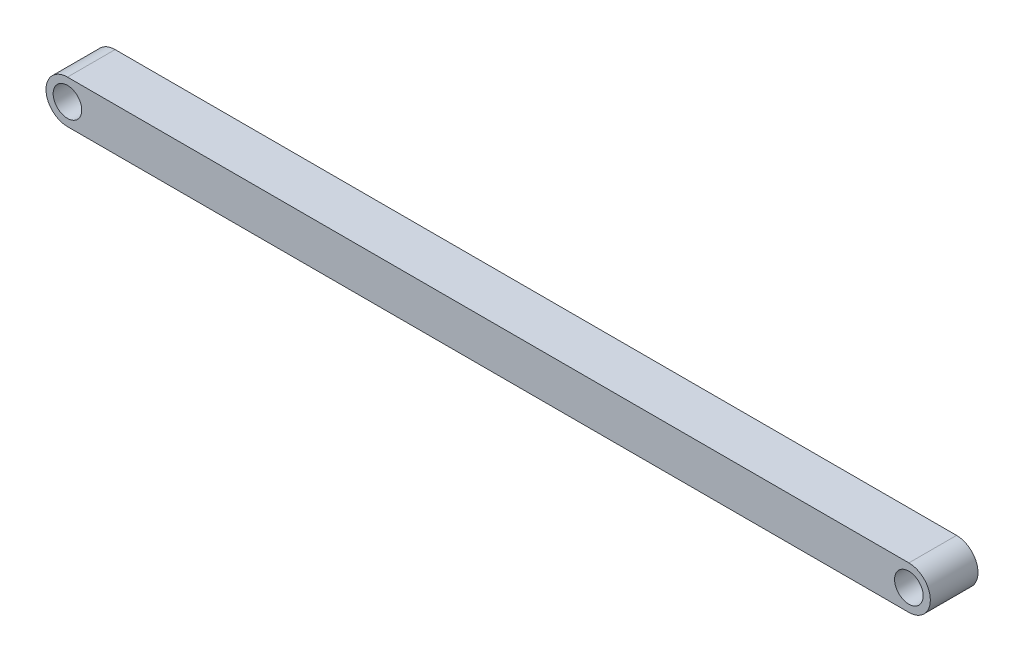
ISO-10303-21;
HEADER;
FILE_DESCRIPTION(('STEP AP214'),'2;1');
FILE_NAME('part.step','',(''),(''),'','','');
FILE_SCHEMA(('AUTOMOTIVE_DESIGN { 1 0 10303 214 1 1 1 1 }'));
ENDSEC;
DATA;
#1=APPLICATION_CONTEXT('core data for automotive mechanical design processes');
#2=APPLICATION_PROTOCOL_DEFINITION('international standard','automotive_design',2000,#1);
#3=PRODUCT_CONTEXT('',#1,'mechanical');
#4=PRODUCT('Part','Part','',(#3));
#5=PRODUCT_RELATED_PRODUCT_CATEGORY('part','',(#4));
#6=PRODUCT_DEFINITION_FORMATION('','',#4);
#7=PRODUCT_DEFINITION_CONTEXT('part definition',#1,'design');
#8=PRODUCT_DEFINITION('design','',#6,#7);
#9=PRODUCT_DEFINITION_SHAPE('','',#8);
#10=(LENGTH_UNIT() NAMED_UNIT(*) SI_UNIT(.MILLI.,.METRE.));
#11=(NAMED_UNIT(*) PLANE_ANGLE_UNIT() SI_UNIT($,.RADIAN.));
#12=(NAMED_UNIT(*) SI_UNIT($,.STERADIAN.) SOLID_ANGLE_UNIT());
#13=UNCERTAINTY_MEASURE_WITH_UNIT(LENGTH_MEASURE(1.E-05),#10,'distance_accuracy_value','');
#14=(GEOMETRIC_REPRESENTATION_CONTEXT(3) GLOBAL_UNCERTAINTY_ASSIGNED_CONTEXT((#13)) GLOBAL_UNIT_ASSIGNED_CONTEXT((#10,
#11,#12)) REPRESENTATION_CONTEXT('',''));
#15=CARTESIAN_POINT('',(0.,0.,0.));
#16=DIRECTION('',(0.,0.,1.));
#17=DIRECTION('',(1.,0.,0.));
#18=AXIS2_PLACEMENT_3D('',#15,#16,#17);
#19=CARTESIAN_POINT('',(0.,0.,-10.));
#20=DIRECTION('',(0.,0.,-1.));
#21=DIRECTION('',(1.,0.,0.));
#22=AXIS2_PLACEMENT_3D('',#19,#20,#21);
#23=PLANE('',#22);
#24=CARTESIAN_POINT('',(0.,0.,-10.));
#25=DIRECTION('',(0.,0.,1.));
#26=DIRECTION('',(1.,0.,0.));
#27=AXIS2_PLACEMENT_3D('',#24,#25,#26);
#28=CIRCLE('',#27,3.);
#29=CARTESIAN_POINT('',(3.,0.,-10.));
#30=VERTEX_POINT('',#29);
#31=EDGE_CURVE('E119',#30,#30,#28,.T.);
#32=ORIENTED_EDGE('',*,*,#31,.T.);
#33=EDGE_LOOP('',(#32));
#34=FACE_BOUND('',#33,.T.);
#35=CARTESIAN_POINT('',(0.,0.,-10.));
#36=DIRECTION('',(0.,0.,1.));
#37=DIRECTION('',(1.,0.,0.));
#38=AXIS2_PLACEMENT_3D('',#35,#36,#37);
#39=CIRCLE('',#38,4.5);
#40=CARTESIAN_POINT('',(0.,4.5,-10.));
#41=VERTEX_POINT('',#40);
#42=CARTESIAN_POINT('',(0.,-4.5,-10.));
#43=VERTEX_POINT('',#42);
#44=EDGE_CURVE('E104',#41,#43,#39,.T.);
#45=ORIENTED_EDGE('',*,*,#44,.F.);
#46=DIRECTION('',(-1.,0.,0.));
#47=VECTOR('',#46,1.);
#48=CARTESIAN_POINT('',(0.,4.5,-10.));
#49=LINE('',#48,#47);
#50=CARTESIAN_POINT('',(176.5,4.5,-10.));
#51=VERTEX_POINT('',#50);
#52=EDGE_CURVE('E107',#51,#41,#49,.T.);
#53=ORIENTED_EDGE('',*,*,#52,.F.);
#54=CARTESIAN_POINT('',(176.5,0.,-10.));
#55=DIRECTION('',(0.,0.,1.));
#56=DIRECTION('',(1.,0.,0.));
#57=AXIS2_PLACEMENT_3D('',#54,#55,#56);
#58=CIRCLE('',#57,4.5);
#59=CARTESIAN_POINT('',(176.5,-4.5,-10.));
#60=VERTEX_POINT('',#59);
#61=EDGE_CURVE('E93',#60,#51,#58,.T.);
#62=ORIENTED_EDGE('',*,*,#61,.F.);
#63=DIRECTION('',(1.,0.,0.));
#64=VECTOR('',#63,1.);
#65=CARTESIAN_POINT('',(0.,-4.5,-10.));
#66=LINE('',#65,#64);
#67=EDGE_CURVE('E99',#43,#60,#66,.T.);
#68=ORIENTED_EDGE('',*,*,#67,.F.);
#69=EDGE_LOOP('',(#45,#53,#62,#68));
#70=FACE_BOUND('',#69,.T.);
#71=CARTESIAN_POINT('',(176.5,0.,-10.));
#72=DIRECTION('',(0.,0.,1.));
#73=DIRECTION('',(1.,0.,0.));
#74=AXIS2_PLACEMENT_3D('',#71,#72,#73);
#75=CIRCLE('',#74,3.);
#76=CARTESIAN_POINT('',(179.5,0.,-10.));
#77=VERTEX_POINT('',#76);
#78=EDGE_CURVE('E137',#77,#77,#75,.T.);
#79=ORIENTED_EDGE('',*,*,#78,.T.);
#80=EDGE_LOOP('',(#79));
#81=FACE_BOUND('',#80,.T.);
#82=ADVANCED_FACE('F45',(#34,#70,#81),#23,.T.);
#83=CARTESIAN_POINT('',(0.,0.,0.));
#84=DIRECTION('',(0.,0.,-1.));
#85=DIRECTION('',(1.,0.,0.));
#86=AXIS2_PLACEMENT_3D('',#83,#84,#85);
#87=PLANE('',#86);
#88=CARTESIAN_POINT('',(0.,0.,0.));
#89=DIRECTION('',(0.,0.,1.));
#90=DIRECTION('',(1.,0.,0.));
#91=AXIS2_PLACEMENT_3D('',#88,#89,#90);
#92=CIRCLE('',#91,4.5);
#93=CARTESIAN_POINT('',(0.,4.5,0.));
#94=VERTEX_POINT('',#93);
#95=CARTESIAN_POINT('',(0.,-4.5,0.));
#96=VERTEX_POINT('',#95);
#97=EDGE_CURVE('E114',#94,#96,#92,.T.);
#98=ORIENTED_EDGE('',*,*,#97,.T.);
#99=DIRECTION('',(1.,0.,0.));
#100=VECTOR('',#99,1.);
#101=CARTESIAN_POINT('',(0.,-4.5,0.));
#102=LINE('',#101,#100);
#103=CARTESIAN_POINT('',(176.5,-4.5,0.));
#104=VERTEX_POINT('',#103);
#105=EDGE_CURVE('E118',#96,#104,#102,.T.);
#106=ORIENTED_EDGE('',*,*,#105,.T.);
#107=CARTESIAN_POINT('',(176.5,0.,0.));
#108=DIRECTION('',(0.,0.,1.));
#109=DIRECTION('',(1.,0.,0.));
#110=AXIS2_PLACEMENT_3D('',#107,#108,#109);
#111=CIRCLE('',#110,4.5);
#112=CARTESIAN_POINT('',(176.5,4.5,0.));
#113=VERTEX_POINT('',#112);
#114=EDGE_CURVE('E96',#104,#113,#111,.T.);
#115=ORIENTED_EDGE('',*,*,#114,.T.);
#116=DIRECTION('',(-1.,0.,0.));
#117=VECTOR('',#116,1.);
#118=CARTESIAN_POINT('',(0.,4.5,0.));
#119=LINE('',#118,#117);
#120=EDGE_CURVE('E124',#113,#94,#119,.T.);
#121=ORIENTED_EDGE('',*,*,#120,.T.);
#122=EDGE_LOOP('',(#98,#106,#115,#121));
#123=FACE_BOUND('',#122,.T.);
#124=CARTESIAN_POINT('',(0.,0.,0.));
#125=DIRECTION('',(0.,0.,1.));
#126=DIRECTION('',(1.,0.,0.));
#127=AXIS2_PLACEMENT_3D('',#124,#125,#126);
#128=CIRCLE('',#127,3.);
#129=CARTESIAN_POINT('',(3.,0.,0.));
#130=VERTEX_POINT('',#129);
#131=EDGE_CURVE('E133',#130,#130,#128,.T.);
#132=ORIENTED_EDGE('',*,*,#131,.F.);
#133=EDGE_LOOP('',(#132));
#134=FACE_BOUND('',#133,.T.);
#135=CARTESIAN_POINT('',(176.5,0.,0.));
#136=DIRECTION('',(0.,0.,1.));
#137=DIRECTION('',(1.,0.,0.));
#138=AXIS2_PLACEMENT_3D('',#135,#136,#137);
#139=CIRCLE('',#138,3.);
#140=CARTESIAN_POINT('',(179.5,0.,0.));
#141=VERTEX_POINT('',#140);
#142=EDGE_CURVE('E141',#141,#141,#139,.T.);
#143=ORIENTED_EDGE('',*,*,#142,.F.);
#144=EDGE_LOOP('',(#143));
#145=FACE_BOUND('',#144,.T.);
#146=ADVANCED_FACE('F156',(#123,#134,#145),#87,.F.);
#147=CARTESIAN_POINT('',(0.,0.,-10.));
#148=DIRECTION('',(0.,0.,1.));
#149=DIRECTION('',(-1.,0.,0.));
#150=AXIS2_PLACEMENT_3D('',#147,#148,#149);
#151=CYLINDRICAL_SURFACE('',#150,4.5);
#152=ORIENTED_EDGE('',*,*,#97,.F.);
#153=DIRECTION('',(0.,0.,1.));
#154=VECTOR('',#153,1.);
#155=CARTESIAN_POINT('',(0.,4.5,-10.));
#156=LINE('',#155,#154);
#157=EDGE_CURVE('E63',#41,#94,#156,.T.);
#158=ORIENTED_EDGE('',*,*,#157,.F.);
#159=ORIENTED_EDGE('',*,*,#44,.T.);
#160=DIRECTION('',(0.,0.,1.));
#161=VECTOR('',#160,1.);
#162=CARTESIAN_POINT('',(0.,-4.5,-10.));
#163=LINE('',#162,#161);
#164=EDGE_CURVE('E11',#43,#96,#163,.T.);
#165=ORIENTED_EDGE('',*,*,#164,.T.);
#166=EDGE_LOOP('',(#152,#158,#159,#165));
#167=FACE_BOUND('',#166,.T.);
#168=ADVANCED_FACE('F47',(#167),#151,.T.);
#169=CARTESIAN_POINT('',(0.,-4.5,-10.));
#170=DIRECTION('',(0.,1.,0.));
#171=DIRECTION('',(0.,0.,-1.));
#172=AXIS2_PLACEMENT_3D('',#169,#170,#171);
#173=PLANE('',#172);
#174=ORIENTED_EDGE('',*,*,#105,.F.);
#175=ORIENTED_EDGE('',*,*,#164,.F.);
#176=ORIENTED_EDGE('',*,*,#67,.T.);
#177=DIRECTION('',(0.,0.,1.));
#178=VECTOR('',#177,1.);
#179=CARTESIAN_POINT('',(176.5,-4.5,-10.));
#180=LINE('',#179,#178);
#181=EDGE_CURVE('E55',#60,#104,#180,.T.);
#182=ORIENTED_EDGE('',*,*,#181,.T.);
#183=EDGE_LOOP('',(#174,#175,#176,#182));
#184=FACE_BOUND('',#183,.T.);
#185=ADVANCED_FACE('F100',(#184),#173,.F.);
#186=CARTESIAN_POINT('',(176.5,0.,-10.));
#187=DIRECTION('',(0.,0.,1.));
#188=DIRECTION('',(-1.,0.,0.));
#189=AXIS2_PLACEMENT_3D('',#186,#187,#188);
#190=CYLINDRICAL_SURFACE('',#189,4.5);
#191=ORIENTED_EDGE('',*,*,#114,.F.);
#192=ORIENTED_EDGE('',*,*,#181,.F.);
#193=ORIENTED_EDGE('',*,*,#61,.T.);
#194=DIRECTION('',(0.,0.,1.));
#195=VECTOR('',#194,1.);
#196=CARTESIAN_POINT('',(176.5,4.5,-10.));
#197=LINE('',#196,#195);
#198=EDGE_CURVE('E79',#51,#113,#197,.T.);
#199=ORIENTED_EDGE('',*,*,#198,.T.);
#200=EDGE_LOOP('',(#191,#192,#193,#199));
#201=FACE_BOUND('',#200,.T.);
#202=ADVANCED_FACE('F91',(#201),#190,.T.);
#203=CARTESIAN_POINT('',(0.,4.5,-10.));
#204=DIRECTION('',(0.,-1.,0.));
#205=DIRECTION('',(0.,0.,1.));
#206=AXIS2_PLACEMENT_3D('',#203,#204,#205);
#207=PLANE('',#206);
#208=ORIENTED_EDGE('',*,*,#120,.F.);
#209=ORIENTED_EDGE('',*,*,#198,.F.);
#210=ORIENTED_EDGE('',*,*,#52,.T.);
#211=ORIENTED_EDGE('',*,*,#157,.T.);
#212=EDGE_LOOP('',(#208,#209,#210,#211));
#213=FACE_BOUND('',#212,.T.);
#214=ADVANCED_FACE('F168',(#213),#207,.F.);
#215=CARTESIAN_POINT('',(0.,0.,-10.));
#216=DIRECTION('',(0.,0.,1.));
#217=DIRECTION('',(-1.,0.,0.));
#218=AXIS2_PLACEMENT_3D('',#215,#216,#217);
#219=CYLINDRICAL_SURFACE('',#218,3.);
#220=ORIENTED_EDGE('',*,*,#31,.F.);
#221=EDGE_LOOP('',(#220));
#222=FACE_BOUND('',#221,.T.);
#223=ORIENTED_EDGE('',*,*,#131,.T.);
#224=EDGE_LOOP('',(#223));
#225=FACE_BOUND('',#224,.T.);
#226=ADVANCED_FACE('F152',(#222,#225),#219,.F.);
#227=CARTESIAN_POINT('',(176.5,0.,-10.));
#228=DIRECTION('',(0.,0.,1.));
#229=DIRECTION('',(-1.,0.,0.));
#230=AXIS2_PLACEMENT_3D('',#227,#228,#229);
#231=CYLINDRICAL_SURFACE('',#230,3.);
#232=ORIENTED_EDGE('',*,*,#78,.F.);
#233=EDGE_LOOP('',(#232));
#234=FACE_BOUND('',#233,.T.);
#235=ORIENTED_EDGE('',*,*,#142,.T.);
#236=EDGE_LOOP('',(#235));
#237=FACE_BOUND('',#236,.T.);
#238=ADVANCED_FACE('F149',(#234,#237),#231,.F.);
#239=CLOSED_SHELL('',(#82,#146,#168,#185,#202,#214,#226,#238));
#240=MANIFOLD_SOLID_BREP('B2',#239);
#241=ADVANCED_BREP_SHAPE_REPRESENTATION('',(#18,#240),#14);
#242=SHAPE_DEFINITION_REPRESENTATION(#9,#241);
ENDSEC;
END-ISO-10303-21;
